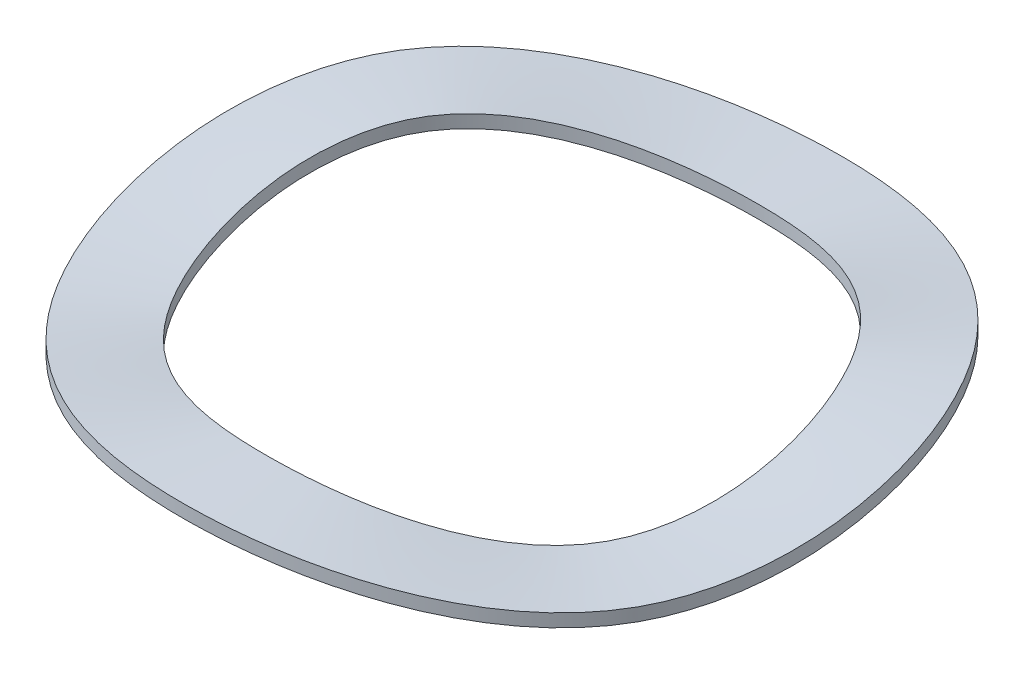
ISO-10303-21;
HEADER;
FILE_DESCRIPTION(('STEP AP214'),'2;1');
FILE_NAME('part.step','',(''),(''),'','','');
FILE_SCHEMA(('AUTOMOTIVE_DESIGN { 1 0 10303 214 1 1 1 1 }'));
ENDSEC;
DATA;
#1=APPLICATION_CONTEXT('core data for automotive mechanical design processes');
#2=APPLICATION_PROTOCOL_DEFINITION('international standard','automotive_design',2000,#1);
#3=PRODUCT_CONTEXT('',#1,'mechanical');
#4=PRODUCT('Part','Part','',(#3));
#5=PRODUCT_RELATED_PRODUCT_CATEGORY('part','',(#4));
#6=PRODUCT_DEFINITION_FORMATION('','',#4);
#7=PRODUCT_DEFINITION_CONTEXT('part definition',#1,'design');
#8=PRODUCT_DEFINITION('design','',#6,#7);
#9=PRODUCT_DEFINITION_SHAPE('','',#8);
#10=(LENGTH_UNIT() NAMED_UNIT(*) SI_UNIT(.MILLI.,.METRE.));
#11=(NAMED_UNIT(*) PLANE_ANGLE_UNIT() SI_UNIT($,.RADIAN.));
#12=(NAMED_UNIT(*) SI_UNIT($,.STERADIAN.) SOLID_ANGLE_UNIT());
#13=UNCERTAINTY_MEASURE_WITH_UNIT(LENGTH_MEASURE(1.E-05),#10,'distance_accuracy_value','');
#14=(GEOMETRIC_REPRESENTATION_CONTEXT(3) GLOBAL_UNCERTAINTY_ASSIGNED_CONTEXT((#13)) GLOBAL_UNIT_ASSIGNED_CONTEXT((#10,
#11,#12)) REPRESENTATION_CONTEXT('',''));
#15=CARTESIAN_POINT('',(0.,0.,0.));
#16=DIRECTION('',(0.,0.,1.));
#17=DIRECTION('',(1.,0.,0.));
#18=AXIS2_PLACEMENT_3D('',#15,#16,#17);
#19=CARTESIAN_POINT('',(0.,0.,-9.65200000000003));
#20=CARTESIAN_POINT('',(3.34355087893097,0.,-9.65200000000002));
#21=CARTESIAN_POINT('',(10.0306526367929,2.38759999999999,-5.79120000000001));
#22=CARTESIAN_POINT('',(10.0306526367929,-1.19379999999999,5.79120000000005));
#23=CARTESIAN_POINT('',(0.,2.38759999999999,11.5824));
#24=CARTESIAN_POINT('',(-10.030652636793,-1.19379999999999,5.79119999999999));
#25=CARTESIAN_POINT('',(-10.0306526367929,1.19379999999999,-1.93040000000005));
#26=CARTESIAN_POINT('',(-6.68710175786192,1.19379999999999,-7.72160000000006));
#27=CARTESIAN_POINT('',(-3.34355087893097,0.,-9.65200000000005));
#28=CARTESIAN_POINT('',(0.,0.,-9.65200000000003));
#29=CARTESIAN_POINT('',(0.,0.,-10.7357333333334));
#30=CARTESIAN_POINT('',(3.71896711796883,0.,-10.7357333333334));
#31=CARTESIAN_POINT('',(11.1569013539065,2.38759999999999,-6.44144000000001));
#32=CARTESIAN_POINT('',(11.1569013539065,-1.19379999999999,6.44144000000006));
#33=CARTESIAN_POINT('',(0.,2.38759999999999,12.88288));
#34=CARTESIAN_POINT('',(-11.1569013539066,-1.19379999999999,6.44143999999999));
#35=CARTESIAN_POINT('',(-11.1569013539065,1.19379999999999,-2.14714666666672));
#36=CARTESIAN_POINT('',(-7.43793423593764,1.19379999999999,-8.58858666666675));
#37=CARTESIAN_POINT('',(-3.71896711796883,0.,-10.7357333333334));
#38=CARTESIAN_POINT('',(0.,0.,-10.7357333333334));
#39=CARTESIAN_POINT('',(0.,0.,-11.8194666666667));
#40=CARTESIAN_POINT('',(4.0943833570067,0.,-11.8194666666667));
#41=CARTESIAN_POINT('',(12.2831500710201,2.38759999999999,-7.09168000000002));
#42=CARTESIAN_POINT('',(12.2831500710201,-1.19379999999999,7.09168000000007));
#43=CARTESIAN_POINT('',(0.,2.38759999999999,14.18336));
#44=CARTESIAN_POINT('',(-12.2831500710202,-1.19379999999999,7.09167999999998));
#45=CARTESIAN_POINT('',(-12.2831500710201,1.19379999999999,-2.3638933333334));
#46=CARTESIAN_POINT('',(-8.18876671401337,1.19379999999999,-9.45557333333342));
#47=CARTESIAN_POINT('',(-4.09438335700669,0.,-11.8194666666667));
#48=CARTESIAN_POINT('',(0.,0.,-11.8194666666667));
#49=CARTESIAN_POINT('',(0.,0.,-12.9032));
#50=CARTESIAN_POINT('',(4.46979959604456,0.,-12.9032));
#51=CARTESIAN_POINT('',(13.4093987881337,2.38759999999999,-7.74192000000002));
#52=CARTESIAN_POINT('',(13.4093987881336,-1.19379999999999,7.74192000000007));
#53=CARTESIAN_POINT('',(0.,2.38759999999999,15.48384));
#54=CARTESIAN_POINT('',(-13.4093987881338,-1.19379999999999,7.74191999999998));
#55=CARTESIAN_POINT('',(-13.4093987881337,1.19379999999999,-2.58064000000007));
#56=CARTESIAN_POINT('',(-8.9395991920891,1.19379999999999,-10.3225600000001));
#57=CARTESIAN_POINT('',(-4.46979959604455,0.,-12.9032000000001));
#58=CARTESIAN_POINT('',(0.,0.,-12.9032));
#59=B_SPLINE_SURFACE_WITH_KNOTS('',3,3,((#19,#20,#21,#22,#23,#24,#25,#26,#27,#28),(#29,#30,#31,
#32,#33,#34,#35,#36,#37,#38),(#39,#40,#41,#42,#43,#44,#45,#46,#47,#48),(#49,#50,#51,#52,#53,#54,
#55,#56,#57,#58)),.UNSPECIFIED.,.F.,.T.,.F.,(4,4),(4,1,1,1,1,2,4),(0.,1.),(0.,0.166666666666667,
0.333333333333334,0.5,0.666666666666666,0.833333333333333,1.),.UNSPECIFIED.);
#60=CARTESIAN_POINT('',(0.,0.,-12.9032));
#61=CARTESIAN_POINT('',(4.46979959604456,0.,-12.9032));
#62=CARTESIAN_POINT('',(13.4093987881337,2.38759999999999,-7.74192000000002));
#63=CARTESIAN_POINT('',(13.4093987881336,-1.19379999999999,7.74192000000007));
#64=CARTESIAN_POINT('',(0.,2.38759999999999,15.48384));
#65=CARTESIAN_POINT('',(-13.4093987881338,-1.19379999999999,7.74191999999998));
#66=CARTESIAN_POINT('',(-13.4093987881337,1.19379999999999,-2.58064000000007));
#67=CARTESIAN_POINT('',(-8.9395991920891,1.19379999999999,-10.3225600000001));
#68=CARTESIAN_POINT('',(-4.46979959604455,0.,-12.9032000000001));
#69=CARTESIAN_POINT('',(0.,0.,-12.9032));
#70=B_SPLINE_CURVE_WITH_KNOTS('',3,(#60,#61,#62,#63,#64,#65,#66,#67,#68,#69),.UNSPECIFIED.,.T.,
.F.,(4,1,1,1,1,2,4),(0.,0.166666666666667,0.333333333333334,0.5,0.666666666666666,
0.833333333333333,1.),.UNSPECIFIED.);
#71=CARTESIAN_POINT('',(0.,0.,-12.9032));
#72=VERTEX_POINT('',#71);
#73=EDGE_CURVE('E21',#72,#72,#70,.F.);
#74=CARTESIAN_POINT('',(0.,0.,-9.65200000000003));
#75=CARTESIAN_POINT('',(3.34355087893097,0.,-9.65200000000002));
#76=CARTESIAN_POINT('',(10.0306526367929,2.38759999999999,-5.79120000000001));
#77=CARTESIAN_POINT('',(10.0306526367929,-1.19379999999999,5.79120000000005));
#78=CARTESIAN_POINT('',(0.,2.38759999999999,11.5824));
#79=CARTESIAN_POINT('',(-10.030652636793,-1.19379999999999,5.79119999999999));
#80=CARTESIAN_POINT('',(-10.0306526367929,1.19379999999999,-1.93040000000005));
#81=CARTESIAN_POINT('',(-6.68710175786192,1.19379999999999,-7.72160000000006));
#82=CARTESIAN_POINT('',(-3.34355087893097,0.,-9.65200000000005));
#83=CARTESIAN_POINT('',(0.,0.,-9.65200000000003));
#84=B_SPLINE_CURVE_WITH_KNOTS('',3,(#74,#75,#76,#77,#78,#79,#80,#81,#82,#83),.UNSPECIFIED.,.T.,
.F.,(4,1,1,1,1,2,4),(0.,0.166666666666667,0.333333333333334,0.5,0.666666666666666,
0.833333333333333,1.),.UNSPECIFIED.);
#85=CARTESIAN_POINT('',(0.,0.,-9.65200000000003));
#86=VERTEX_POINT('',#85);
#87=EDGE_CURVE('E32',#86,#86,#84,.T.);
#88=ORIENTED_EDGE('',*,*,#73,.F.);
#89=EDGE_LOOP('',(#88));
#90=FACE_BOUND('',#89,.T.);
#91=ORIENTED_EDGE('',*,*,#87,.F.);
#92=EDGE_LOOP('',(#91));
#93=FACE_BOUND('',#92,.T.);
#94=ADVANCED_FACE('F15',(#90,#93),#59,.T.);
#95=CARTESIAN_POINT('',(0.,0.,-12.9032));
#96=CARTESIAN_POINT('',(4.46979959604456,0.,-12.9032));
#97=CARTESIAN_POINT('',(13.4093987881337,2.38759999999999,-7.74192000000002));
#98=CARTESIAN_POINT('',(13.4093987881336,-1.19379999999999,7.74192000000007));
#99=CARTESIAN_POINT('',(0.,2.38759999999999,15.48384));
#100=CARTESIAN_POINT('',(-13.4093987881338,-1.19379999999999,7.74191999999998));
#101=CARTESIAN_POINT('',(-13.4093987881337,1.19379999999999,-2.58064000000007));
#102=CARTESIAN_POINT('',(-8.9395991920891,1.19379999999999,-10.3225600000001));
#103=CARTESIAN_POINT('',(-4.46979959604455,0.,-12.9032000000001));
#104=CARTESIAN_POINT('',(0.,0.,-12.9032));
#105=CARTESIAN_POINT('',(0.,0.169333333333327,-12.9032));
#106=CARTESIAN_POINT('',(4.46979959604456,0.169333333333327,-12.9032));
#107=CARTESIAN_POINT('',(13.4093987881337,2.55693333333334,-7.74192000000002));
#108=CARTESIAN_POINT('',(13.4093987881336,-1.02446666666667,7.74192000000007));
#109=CARTESIAN_POINT('',(0.,2.55693333333334,15.48384));
#110=CARTESIAN_POINT('',(-13.4093987881338,-1.02446666666667,7.74191999999998));
#111=CARTESIAN_POINT('',(-13.4093987881337,1.36313333333332,-2.58064000000007));
#112=CARTESIAN_POINT('',(-8.9395991920891,1.36313333333332,-10.3225600000001));
#113=CARTESIAN_POINT('',(-4.46979959604455,0.169333333333327,-12.9032000000001));
#114=CARTESIAN_POINT('',(0.,0.169333333333327,-12.9032));
#115=CARTESIAN_POINT('',(0.,0.338666666666654,-12.9032));
#116=CARTESIAN_POINT('',(4.46979959604456,0.338666666666654,-12.9032));
#117=CARTESIAN_POINT('',(13.4093987881337,2.72626666666667,-7.74192000000002));
#118=CARTESIAN_POINT('',(13.4093987881336,-0.855133333333341,7.74192000000007));
#119=CARTESIAN_POINT('',(0.,2.72626666666667,15.48384));
#120=CARTESIAN_POINT('',(-13.4093987881338,-0.855133333333341,7.74191999999997));
#121=CARTESIAN_POINT('',(-13.4093987881337,1.53246666666668,-2.58064000000007));
#122=CARTESIAN_POINT('',(-8.9395991920891,1.53246666666668,-10.3225600000001));
#123=CARTESIAN_POINT('',(-4.46979959604455,0.338666666666654,-12.9032000000001));
#124=CARTESIAN_POINT('',(0.,0.338666666666654,-12.9032));
#125=CARTESIAN_POINT('',(0.,0.508000000000008,-12.9032));
#126=CARTESIAN_POINT('',(4.46979959604456,0.508000000000008,-12.9032));
#127=CARTESIAN_POINT('',(13.4093987881337,2.8956,-7.74192000000002));
#128=CARTESIAN_POINT('',(13.4093987881336,-0.685799999999986,7.74192000000007));
#129=CARTESIAN_POINT('',(0.,2.8956,15.48384));
#130=CARTESIAN_POINT('',(-13.4093987881338,-0.685799999999986,7.74191999999997));
#131=CARTESIAN_POINT('',(-13.4093987881337,1.7018,-2.58064000000007));
#132=CARTESIAN_POINT('',(-8.9395991920891,1.7018,-10.3225600000001));
#133=CARTESIAN_POINT('',(-4.46979959604455,0.508000000000008,-12.9032000000001));
#134=CARTESIAN_POINT('',(0.,0.508000000000008,-12.9032));
#135=B_SPLINE_SURFACE_WITH_KNOTS('',3,3,((#95,#96,#97,#98,#99,#100,#101,#102,#103,#104),(#105,
#106,#107,#108,#109,#110,#111,#112,#113,#114),(#115,#116,#117,#118,#119,#120,#121,#122,#123,
#124),(#125,#126,#127,#128,#129,#130,#131,#132,#133,#134)),.UNSPECIFIED.,.F.,.T.,.F.,(4,4),(4,1,
1,1,1,2,4),(0.,1.),(0.,0.166666666666667,0.333333333333334,0.5,0.666666666666666,
0.833333333333333,1.),.UNSPECIFIED.);
#136=CARTESIAN_POINT('',(0.,0.508000000000008,-12.9032));
#137=CARTESIAN_POINT('',(4.46979959604456,0.508000000000008,-12.9032));
#138=CARTESIAN_POINT('',(13.4093987881337,2.8956,-7.74192000000002));
#139=CARTESIAN_POINT('',(13.4093987881336,-0.685799999999986,7.74192000000007));
#140=CARTESIAN_POINT('',(0.,2.8956,15.48384));
#141=CARTESIAN_POINT('',(-13.4093987881338,-0.685799999999986,7.74191999999997));
#142=CARTESIAN_POINT('',(-13.4093987881337,1.7018,-2.58064000000007));
#143=CARTESIAN_POINT('',(-8.9395991920891,1.7018,-10.3225600000001));
#144=CARTESIAN_POINT('',(-4.46979959604455,0.508000000000008,-12.9032000000001));
#145=CARTESIAN_POINT('',(0.,0.508000000000008,-12.9032));
#146=B_SPLINE_CURVE_WITH_KNOTS('',3,(#136,#137,#138,#139,#140,#141,#142,#143,#144,#145),
.UNSPECIFIED.,.T.,.F.,(4,1,1,1,1,2,4),(0.,0.166666666666667,0.333333333333334,0.5,
0.666666666666666,0.833333333333333,1.),.UNSPECIFIED.);
#147=CARTESIAN_POINT('',(0.,0.508000000000008,-12.9032));
#148=VERTEX_POINT('',#147);
#149=EDGE_CURVE('E27',#148,#148,#146,.F.);
#150=ORIENTED_EDGE('',*,*,#149,.F.);
#151=EDGE_LOOP('',(#150));
#152=FACE_BOUND('',#151,.T.);
#153=ORIENTED_EDGE('',*,*,#73,.T.);
#154=EDGE_LOOP('',(#153));
#155=FACE_BOUND('',#154,.T.);
#156=ADVANCED_FACE('F55',(#152,#155),#135,.T.);
#157=CARTESIAN_POINT('',(0.,0.508000000000008,-9.65200000000003));
#158=CARTESIAN_POINT('',(3.34355087893097,0.508000000000008,-9.65200000000002));
#159=CARTESIAN_POINT('',(10.0306526367929,2.8956,-5.79120000000001));
#160=CARTESIAN_POINT('',(10.0306526367929,-0.685800000000014,5.79120000000005));
#161=CARTESIAN_POINT('',(0.,2.8956,11.5824));
#162=CARTESIAN_POINT('',(-10.030652636793,-0.685800000000014,5.79119999999999));
#163=CARTESIAN_POINT('',(-10.0306526367929,1.7018,-1.93040000000005));
#164=CARTESIAN_POINT('',(-6.68710175786192,1.7018,-7.72160000000005));
#165=CARTESIAN_POINT('',(-3.34355087893097,0.508000000000008,-9.65200000000005));
#166=CARTESIAN_POINT('',(0.,0.508000000000008,-9.65200000000003));
#167=CARTESIAN_POINT('',(0.,0.338666666666654,-9.65200000000003));
#168=CARTESIAN_POINT('',(3.34355087893097,0.338666666666654,-9.65200000000002));
#169=CARTESIAN_POINT('',(10.0306526367929,2.72626666666667,-5.79120000000001));
#170=CARTESIAN_POINT('',(10.0306526367929,-0.855133333333341,5.79120000000005));
#171=CARTESIAN_POINT('',(0.,2.72626666666667,11.5824));
#172=CARTESIAN_POINT('',(-10.030652636793,-0.855133333333341,5.79119999999999));
#173=CARTESIAN_POINT('',(-10.0306526367929,1.53246666666668,-1.93040000000005));
#174=CARTESIAN_POINT('',(-6.68710175786192,1.53246666666668,-7.72160000000005));
#175=CARTESIAN_POINT('',(-3.34355087893097,0.338666666666654,-9.65200000000005));
#176=CARTESIAN_POINT('',(0.,0.338666666666654,-9.65200000000003));
#177=CARTESIAN_POINT('',(0.,0.169333333333327,-9.65200000000003));
#178=CARTESIAN_POINT('',(3.34355087893097,0.169333333333327,-9.65200000000002));
#179=CARTESIAN_POINT('',(10.0306526367929,2.55693333333334,-5.79120000000001));
#180=CARTESIAN_POINT('',(10.0306526367929,-1.02446666666667,5.79120000000005));
#181=CARTESIAN_POINT('',(0.,2.55693333333334,11.5824));
#182=CARTESIAN_POINT('',(-10.030652636793,-1.02446666666667,5.79119999999999));
#183=CARTESIAN_POINT('',(-10.0306526367929,1.36313333333332,-1.93040000000005));
#184=CARTESIAN_POINT('',(-6.68710175786192,1.36313333333332,-7.72160000000006));
#185=CARTESIAN_POINT('',(-3.34355087893097,0.169333333333327,-9.65200000000004));
#186=CARTESIAN_POINT('',(0.,0.169333333333327,-9.65200000000003));
#187=CARTESIAN_POINT('',(0.,0.,-9.65200000000003));
#188=CARTESIAN_POINT('',(3.34355087893097,0.,-9.65200000000002));
#189=CARTESIAN_POINT('',(10.0306526367929,2.38759999999999,-5.79120000000001));
#190=CARTESIAN_POINT('',(10.0306526367929,-1.19379999999999,5.79120000000005));
#191=CARTESIAN_POINT('',(0.,2.38759999999999,11.5824));
#192=CARTESIAN_POINT('',(-10.030652636793,-1.19379999999999,5.79119999999999));
#193=CARTESIAN_POINT('',(-10.0306526367929,1.19379999999999,-1.93040000000005));
#194=CARTESIAN_POINT('',(-6.68710175786192,1.19379999999999,-7.72160000000006));
#195=CARTESIAN_POINT('',(-3.34355087893097,0.,-9.65200000000005));
#196=CARTESIAN_POINT('',(0.,0.,-9.65200000000003));
#197=B_SPLINE_SURFACE_WITH_KNOTS('',3,3,((#157,#158,#159,#160,#161,#162,#163,#164,#165,#166),
(#167,#168,#169,#170,#171,#172,#173,#174,#175,#176),(#177,#178,#179,#180,#181,#182,#183,#184,
#185,#186),(#187,#188,#189,#190,#191,#192,#193,#194,#195,#196)),.UNSPECIFIED.,.F.,.T.,.F.,(4,4),
(4,1,1,1,1,2,4),(0.,1.),(0.,0.166666666666667,0.333333333333334,0.5,0.666666666666666,
0.833333333333333,1.),.UNSPECIFIED.);
#198=CARTESIAN_POINT('',(0.,0.508000000000008,-9.65200000000003));
#199=CARTESIAN_POINT('',(3.34355087893097,0.508000000000008,-9.65200000000002));
#200=CARTESIAN_POINT('',(10.0306526367929,2.8956,-5.79120000000001));
#201=CARTESIAN_POINT('',(10.0306526367929,-0.685800000000014,5.79120000000005));
#202=CARTESIAN_POINT('',(0.,2.8956,11.5824));
#203=CARTESIAN_POINT('',(-10.030652636793,-0.685800000000014,5.79119999999999));
#204=CARTESIAN_POINT('',(-10.0306526367929,1.7018,-1.93040000000005));
#205=CARTESIAN_POINT('',(-6.68710175786192,1.7018,-7.72160000000005));
#206=CARTESIAN_POINT('',(-3.34355087893097,0.508000000000008,-9.65200000000005));
#207=CARTESIAN_POINT('',(0.,0.508000000000008,-9.65200000000003));
#208=B_SPLINE_CURVE_WITH_KNOTS('',3,(#198,#199,#200,#201,#202,#203,#204,#205,#206,#207),
.UNSPECIFIED.,.T.,.F.,(4,1,1,1,1,2,4),(0.,0.166666666666667,0.333333333333334,0.5,
0.666666666666666,0.833333333333333,1.),.UNSPECIFIED.);
#209=CARTESIAN_POINT('',(0.,0.508000000000008,-9.65200000000003));
#210=VERTEX_POINT('',#209);
#211=EDGE_CURVE('E10',#210,#210,#208,.T.);
#212=ORIENTED_EDGE('',*,*,#87,.T.);
#213=EDGE_LOOP('',(#212));
#214=FACE_BOUND('',#213,.T.);
#215=ORIENTED_EDGE('',*,*,#211,.F.);
#216=EDGE_LOOP('',(#215));
#217=FACE_BOUND('',#216,.T.);
#218=ADVANCED_FACE('F64',(#214,#217),#197,.T.);
#219=CARTESIAN_POINT('',(0.,0.508000000000008,-12.9032));
#220=CARTESIAN_POINT('',(4.46979959604456,0.508000000000008,-12.9032));
#221=CARTESIAN_POINT('',(13.4093987881337,2.8956,-7.74192000000002));
#222=CARTESIAN_POINT('',(13.4093987881336,-0.685799999999986,7.74192000000007));
#223=CARTESIAN_POINT('',(0.,2.8956,15.48384));
#224=CARTESIAN_POINT('',(-13.4093987881338,-0.685799999999986,7.74191999999997));
#225=CARTESIAN_POINT('',(-13.4093987881337,1.7018,-2.58064000000007));
#226=CARTESIAN_POINT('',(-8.9395991920891,1.7018,-10.3225600000001));
#227=CARTESIAN_POINT('',(-4.46979959604455,0.508000000000008,-12.9032000000001));
#228=CARTESIAN_POINT('',(0.,0.508000000000008,-12.9032));
#229=CARTESIAN_POINT('',(0.,0.508000000000008,-11.8194666666667));
#230=CARTESIAN_POINT('',(4.0943833570067,0.508000000000008,-11.8194666666667));
#231=CARTESIAN_POINT('',(12.2831500710201,2.8956,-7.09168000000002));
#232=CARTESIAN_POINT('',(12.2831500710201,-0.685799999999986,7.09168000000007));
#233=CARTESIAN_POINT('',(0.,2.8956,14.18336));
#234=CARTESIAN_POINT('',(-12.2831500710202,-0.685800000000014,7.09167999999997));
#235=CARTESIAN_POINT('',(-12.2831500710201,1.7018,-2.3638933333334));
#236=CARTESIAN_POINT('',(-8.18876671401337,1.7018,-9.45557333333342));
#237=CARTESIAN_POINT('',(-4.09438335700669,0.508000000000008,-11.8194666666667));
#238=CARTESIAN_POINT('',(0.,0.508000000000008,-11.8194666666667));
#239=CARTESIAN_POINT('',(0.,0.508000000000008,-10.7357333333334));
#240=CARTESIAN_POINT('',(3.71896711796883,0.508000000000008,-10.7357333333334));
#241=CARTESIAN_POINT('',(11.1569013539065,2.8956,-6.44144));
#242=CARTESIAN_POINT('',(11.1569013539065,-0.685799999999986,6.44144000000006));
#243=CARTESIAN_POINT('',(0.,2.8956,12.88288));
#244=CARTESIAN_POINT('',(-11.1569013539066,-0.685800000000014,6.44143999999999));
#245=CARTESIAN_POINT('',(-11.1569013539065,1.7018,-2.14714666666673));
#246=CARTESIAN_POINT('',(-7.43793423593765,1.7018,-8.58858666666675));
#247=CARTESIAN_POINT('',(-3.71896711796883,0.508000000000008,-10.7357333333334));
#248=CARTESIAN_POINT('',(0.,0.508000000000008,-10.7357333333334));
#249=CARTESIAN_POINT('',(0.,0.508000000000008,-9.65200000000003));
#250=CARTESIAN_POINT('',(3.34355087893097,0.508000000000008,-9.65200000000002));
#251=CARTESIAN_POINT('',(10.0306526367929,2.8956,-5.79120000000001));
#252=CARTESIAN_POINT('',(10.0306526367929,-0.685800000000014,5.79120000000005));
#253=CARTESIAN_POINT('',(0.,2.8956,11.5824));
#254=CARTESIAN_POINT('',(-10.030652636793,-0.685800000000014,5.79119999999999));
#255=CARTESIAN_POINT('',(-10.0306526367929,1.7018,-1.93040000000005));
#256=CARTESIAN_POINT('',(-6.68710175786192,1.7018,-7.72160000000005));
#257=CARTESIAN_POINT('',(-3.34355087893097,0.508000000000008,-9.65200000000005));
#258=CARTESIAN_POINT('',(0.,0.508000000000008,-9.65200000000003));
#259=B_SPLINE_SURFACE_WITH_KNOTS('',3,3,((#219,#220,#221,#222,#223,#224,#225,#226,#227,#228),
(#229,#230,#231,#232,#233,#234,#235,#236,#237,#238),(#239,#240,#241,#242,#243,#244,#245,#246,
#247,#248),(#249,#250,#251,#252,#253,#254,#255,#256,#257,#258)),.UNSPECIFIED.,.F.,.T.,.F.,(4,4),
(4,1,1,1,1,2,4),(0.,1.),(0.,0.166666666666667,0.333333333333334,0.5,0.666666666666666,
0.833333333333333,1.),.UNSPECIFIED.);
#260=ORIENTED_EDGE('',*,*,#211,.T.);
#261=EDGE_LOOP('',(#260));
#262=FACE_BOUND('',#261,.T.);
#263=ORIENTED_EDGE('',*,*,#149,.T.);
#264=EDGE_LOOP('',(#263));
#265=FACE_BOUND('',#264,.T.);
#266=ADVANCED_FACE('F17',(#262,#265),#259,.T.);
#267=CLOSED_SHELL('',(#94,#156,#218,#266));
#268=MANIFOLD_SOLID_BREP('B1',#267);
#269=ADVANCED_BREP_SHAPE_REPRESENTATION('',(#18,#268),#14);
#270=SHAPE_DEFINITION_REPRESENTATION(#9,#269);
ENDSEC;
END-ISO-10303-21;
